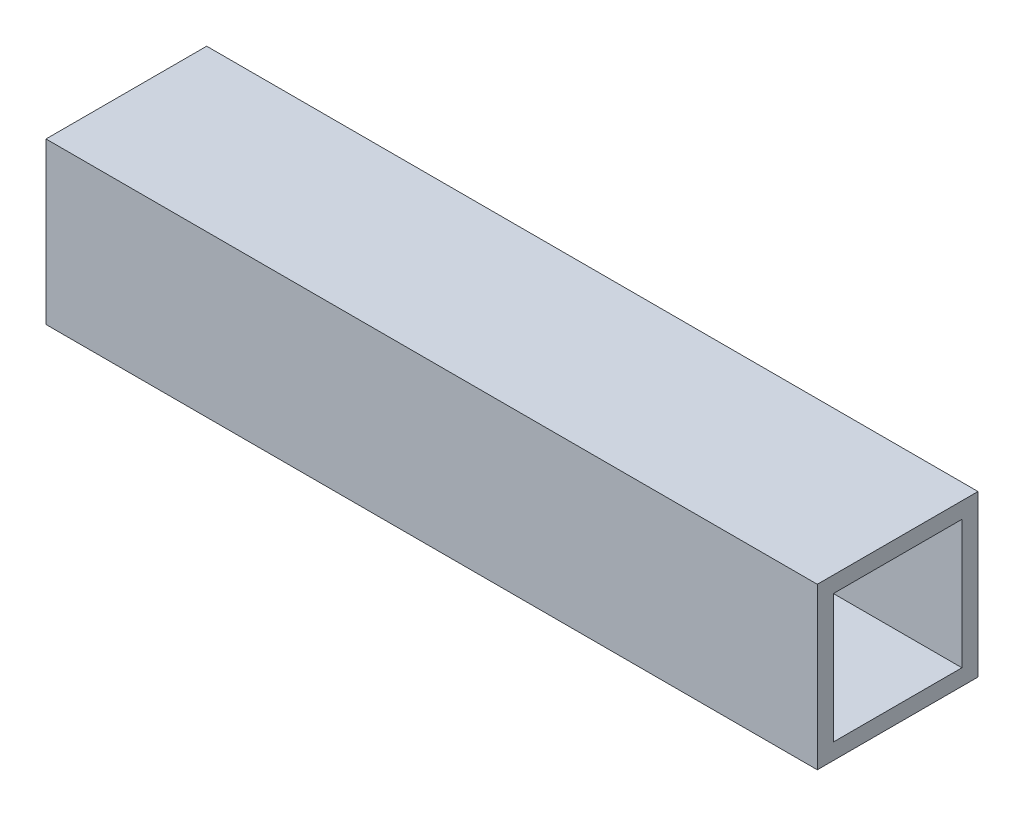
ISO-10303-21;
HEADER;
FILE_DESCRIPTION(('STEP AP214'),'2;1');
FILE_NAME('part.step','',(''),(''),'','','');
FILE_SCHEMA(('AUTOMOTIVE_DESIGN { 1 0 10303 214 1 1 1 1 }'));
ENDSEC;
DATA;
#1=APPLICATION_CONTEXT('core data for automotive mechanical design processes');
#2=APPLICATION_PROTOCOL_DEFINITION('international standard','automotive_design',2000,#1);
#3=PRODUCT_CONTEXT('',#1,'mechanical');
#4=PRODUCT('Part','Part','',(#3));
#5=PRODUCT_RELATED_PRODUCT_CATEGORY('part','',(#4));
#6=PRODUCT_DEFINITION_FORMATION('','',#4);
#7=PRODUCT_DEFINITION_CONTEXT('part definition',#1,'design');
#8=PRODUCT_DEFINITION('design','',#6,#7);
#9=PRODUCT_DEFINITION_SHAPE('','',#8);
#10=(LENGTH_UNIT() NAMED_UNIT(*) SI_UNIT(.MILLI.,.METRE.));
#11=(NAMED_UNIT(*) PLANE_ANGLE_UNIT() SI_UNIT($,.RADIAN.));
#12=(NAMED_UNIT(*) SI_UNIT($,.STERADIAN.) SOLID_ANGLE_UNIT());
#13=UNCERTAINTY_MEASURE_WITH_UNIT(LENGTH_MEASURE(1.E-05),#10,'distance_accuracy_value','');
#14=(GEOMETRIC_REPRESENTATION_CONTEXT(3) GLOBAL_UNCERTAINTY_ASSIGNED_CONTEXT((#13)) GLOBAL_UNIT_ASSIGNED_CONTEXT((#10,
#11,#12)) REPRESENTATION_CONTEXT('',''));
#15=CARTESIAN_POINT('',(0.,0.,0.));
#16=DIRECTION('',(0.,0.,1.));
#17=DIRECTION('',(1.,0.,0.));
#18=AXIS2_PLACEMENT_3D('',#15,#16,#17);
#19=CARTESIAN_POINT('',(152.4,0.,0.));
#20=DIRECTION('',(1.,0.,0.));
#21=DIRECTION('',(0.,0.,-1.));
#22=AXIS2_PLACEMENT_3D('',#19,#20,#21);
#23=PLANE('',#22);
#24=DIRECTION('',(0.,0.,-1.));
#25=VECTOR('',#24,1.);
#26=CARTESIAN_POINT('',(152.4,-31.75,31.75));
#27=LINE('',#26,#25);
#28=CARTESIAN_POINT('',(152.4,-31.75,31.75));
#29=VERTEX_POINT('',#28);
#30=CARTESIAN_POINT('',(152.4,-31.75,-31.75));
#31=VERTEX_POINT('',#30);
#32=EDGE_CURVE('E141',#29,#31,#27,.T.);
#33=ORIENTED_EDGE('',*,*,#32,.T.);
#34=DIRECTION('',(0.,1.,0.));
#35=VECTOR('',#34,1.);
#36=CARTESIAN_POINT('',(152.4,-31.75,-31.75));
#37=LINE('',#36,#35);
#38=CARTESIAN_POINT('',(152.4,31.75,-31.75));
#39=VERTEX_POINT('',#38);
#40=EDGE_CURVE('E144',#31,#39,#37,.T.);
#41=ORIENTED_EDGE('',*,*,#40,.T.);
#42=DIRECTION('',(0.,0.,1.));
#43=VECTOR('',#42,1.);
#44=CARTESIAN_POINT('',(152.4,31.75,31.75));
#45=LINE('',#44,#43);
#46=CARTESIAN_POINT('',(152.4,31.75,31.75));
#47=VERTEX_POINT('',#46);
#48=EDGE_CURVE('E147',#39,#47,#45,.T.);
#49=ORIENTED_EDGE('',*,*,#48,.T.);
#50=DIRECTION('',(0.,-1.,0.));
#51=VECTOR('',#50,1.);
#52=CARTESIAN_POINT('',(152.4,-31.75,31.75));
#53=LINE('',#52,#51);
#54=EDGE_CURVE('E149',#47,#29,#53,.T.);
#55=ORIENTED_EDGE('',*,*,#54,.T.);
#56=EDGE_LOOP('',(#33,#41,#49,#55));
#57=FACE_BOUND('',#56,.T.);
#58=DIRECTION('',(0.,0.,1.));
#59=VECTOR('',#58,1.);
#60=CARTESIAN_POINT('',(152.4,25.4,25.4));
#61=LINE('',#60,#59);
#62=CARTESIAN_POINT('',(152.4,25.4,-25.4));
#63=VERTEX_POINT('',#62);
#64=CARTESIAN_POINT('',(152.4,25.4,25.4));
#65=VERTEX_POINT('',#64);
#66=EDGE_CURVE('E113',#63,#65,#61,.T.);
#67=ORIENTED_EDGE('',*,*,#66,.F.);
#68=DIRECTION('',(0.,1.,0.));
#69=VECTOR('',#68,1.);
#70=CARTESIAN_POINT('',(152.4,-25.4,-25.4));
#71=LINE('',#70,#69);
#72=CARTESIAN_POINT('',(152.4,-25.4,-25.4));
#73=VERTEX_POINT('',#72);
#74=EDGE_CURVE('E105',#73,#63,#71,.T.);
#75=ORIENTED_EDGE('',*,*,#74,.F.);
#76=DIRECTION('',(0.,0.,-1.));
#77=VECTOR('',#76,1.);
#78=CARTESIAN_POINT('',(152.4,-25.4,25.4));
#79=LINE('',#78,#77);
#80=CARTESIAN_POINT('',(152.4,-25.4,25.4));
#81=VERTEX_POINT('',#80);
#82=EDGE_CURVE('E127',#81,#73,#79,.T.);
#83=ORIENTED_EDGE('',*,*,#82,.F.);
#84=DIRECTION('',(0.,-1.,0.));
#85=VECTOR('',#84,1.);
#86=CARTESIAN_POINT('',(152.4,-25.4,25.4));
#87=LINE('',#86,#85);
#88=EDGE_CURVE('E125',#65,#81,#87,.T.);
#89=ORIENTED_EDGE('',*,*,#88,.F.);
#90=EDGE_LOOP('',(#67,#75,#83,#89));
#91=FACE_BOUND('',#90,.T.);
#92=ADVANCED_FACE('F40',(#57,#91),#23,.T.);
#93=CARTESIAN_POINT('',(-152.4,0.,0.));
#94=DIRECTION('',(1.,0.,0.));
#95=DIRECTION('',(0.,0.,-1.));
#96=AXIS2_PLACEMENT_3D('',#93,#94,#95);
#97=PLANE('',#96);
#98=DIRECTION('',(0.,0.,-1.));
#99=VECTOR('',#98,1.);
#100=CARTESIAN_POINT('',(-152.4,-31.75,31.75));
#101=LINE('',#100,#99);
#102=CARTESIAN_POINT('',(-152.4,-31.75,31.75));
#103=VERTEX_POINT('',#102);
#104=CARTESIAN_POINT('',(-152.4,-31.75,-31.75));
#105=VERTEX_POINT('',#104);
#106=EDGE_CURVE('E121',#103,#105,#101,.T.);
#107=ORIENTED_EDGE('',*,*,#106,.F.);
#108=DIRECTION('',(0.,-1.,0.));
#109=VECTOR('',#108,1.);
#110=CARTESIAN_POINT('',(-152.4,-31.75,31.75));
#111=LINE('',#110,#109);
#112=CARTESIAN_POINT('',(-152.4,31.75,31.75));
#113=VERTEX_POINT('',#112);
#114=EDGE_CURVE('E145',#113,#103,#111,.T.);
#115=ORIENTED_EDGE('',*,*,#114,.F.);
#116=DIRECTION('',(0.,0.,1.));
#117=VECTOR('',#116,1.);
#118=CARTESIAN_POINT('',(-152.4,31.75,31.75));
#119=LINE('',#118,#117);
#120=CARTESIAN_POINT('',(-152.4,31.75,-31.75));
#121=VERTEX_POINT('',#120);
#122=EDGE_CURVE('E156',#121,#113,#119,.T.);
#123=ORIENTED_EDGE('',*,*,#122,.F.);
#124=DIRECTION('',(0.,1.,0.));
#125=VECTOR('',#124,1.);
#126=CARTESIAN_POINT('',(-152.4,-31.75,-31.75));
#127=LINE('',#126,#125);
#128=EDGE_CURVE('E154',#105,#121,#127,.T.);
#129=ORIENTED_EDGE('',*,*,#128,.F.);
#130=EDGE_LOOP('',(#107,#115,#123,#129));
#131=FACE_BOUND('',#130,.T.);
#132=DIRECTION('',(0.,1.,0.));
#133=VECTOR('',#132,1.);
#134=CARTESIAN_POINT('',(-152.4,-25.4,-25.4));
#135=LINE('',#134,#133);
#136=CARTESIAN_POINT('',(-152.4,-25.4,-25.4));
#137=VERTEX_POINT('',#136);
#138=CARTESIAN_POINT('',(-152.4,25.4,-25.4));
#139=VERTEX_POINT('',#138);
#140=EDGE_CURVE('E63',#137,#139,#135,.T.);
#141=ORIENTED_EDGE('',*,*,#140,.T.);
#142=DIRECTION('',(0.,0.,1.));
#143=VECTOR('',#142,1.);
#144=CARTESIAN_POINT('',(-152.4,25.4,25.4));
#145=LINE('',#144,#143);
#146=CARTESIAN_POINT('',(-152.4,25.4,25.4));
#147=VERTEX_POINT('',#146);
#148=EDGE_CURVE('E120',#139,#147,#145,.T.);
#149=ORIENTED_EDGE('',*,*,#148,.T.);
#150=DIRECTION('',(0.,-1.,0.));
#151=VECTOR('',#150,1.);
#152=CARTESIAN_POINT('',(-152.4,-25.4,25.4));
#153=LINE('',#152,#151);
#154=CARTESIAN_POINT('',(-152.4,-25.4,25.4));
#155=VERTEX_POINT('',#154);
#156=EDGE_CURVE('E133',#147,#155,#153,.T.);
#157=ORIENTED_EDGE('',*,*,#156,.T.);
#158=DIRECTION('',(0.,0.,-1.));
#159=VECTOR('',#158,1.);
#160=CARTESIAN_POINT('',(-152.4,-25.4,25.4));
#161=LINE('',#160,#159);
#162=EDGE_CURVE('E114',#155,#137,#161,.T.);
#163=ORIENTED_EDGE('',*,*,#162,.T.);
#164=EDGE_LOOP('',(#141,#149,#157,#163));
#165=FACE_BOUND('',#164,.T.);
#166=ADVANCED_FACE('F174',(#131,#165),#97,.F.);
#167=CARTESIAN_POINT('',(152.4,-31.75,31.75));
#168=DIRECTION('',(0.,1.,0.));
#169=DIRECTION('',(0.,0.,1.));
#170=AXIS2_PLACEMENT_3D('',#167,#168,#169);
#171=PLANE('',#170);
#172=ORIENTED_EDGE('',*,*,#106,.T.);
#173=DIRECTION('',(-1.,0.,0.));
#174=VECTOR('',#173,1.);
#175=CARTESIAN_POINT('',(152.4,-31.75,-31.75));
#176=LINE('',#175,#174);
#177=EDGE_CURVE('E11',#31,#105,#176,.T.);
#178=ORIENTED_EDGE('',*,*,#177,.F.);
#179=ORIENTED_EDGE('',*,*,#32,.F.);
#180=DIRECTION('',(-1.,0.,0.));
#181=VECTOR('',#180,1.);
#182=CARTESIAN_POINT('',(152.4,-31.75,31.75));
#183=LINE('',#182,#181);
#184=EDGE_CURVE('E151',#29,#103,#183,.T.);
#185=ORIENTED_EDGE('',*,*,#184,.T.);
#186=EDGE_LOOP('',(#172,#178,#179,#185));
#187=FACE_BOUND('',#186,.T.);
#188=ADVANCED_FACE('F42',(#187),#171,.F.);
#189=CARTESIAN_POINT('',(152.4,-31.75,-31.75));
#190=DIRECTION('',(0.,0.,1.));
#191=DIRECTION('',(1.,0.,0.));
#192=AXIS2_PLACEMENT_3D('',#189,#190,#191);
#193=PLANE('',#192);
#194=ORIENTED_EDGE('',*,*,#128,.T.);
#195=DIRECTION('',(-1.,0.,0.));
#196=VECTOR('',#195,1.);
#197=CARTESIAN_POINT('',(152.4,31.75,-31.75));
#198=LINE('',#197,#196);
#199=EDGE_CURVE('E48',#39,#121,#198,.T.);
#200=ORIENTED_EDGE('',*,*,#199,.F.);
#201=ORIENTED_EDGE('',*,*,#40,.F.);
#202=ORIENTED_EDGE('',*,*,#177,.T.);
#203=EDGE_LOOP('',(#194,#200,#201,#202));
#204=FACE_BOUND('',#203,.T.);
#205=ADVANCED_FACE('F184',(#204),#193,.F.);
#206=CARTESIAN_POINT('',(152.4,31.75,31.75));
#207=DIRECTION('',(0.,-1.,0.));
#208=DIRECTION('',(0.,0.,-1.));
#209=AXIS2_PLACEMENT_3D('',#206,#207,#208);
#210=PLANE('',#209);
#211=ORIENTED_EDGE('',*,*,#122,.T.);
#212=DIRECTION('',(-1.,0.,0.));
#213=VECTOR('',#212,1.);
#214=CARTESIAN_POINT('',(152.4,31.75,31.75));
#215=LINE('',#214,#213);
#216=EDGE_CURVE('E161',#47,#113,#215,.T.);
#217=ORIENTED_EDGE('',*,*,#216,.F.);
#218=ORIENTED_EDGE('',*,*,#48,.F.);
#219=ORIENTED_EDGE('',*,*,#199,.T.);
#220=EDGE_LOOP('',(#211,#217,#218,#219));
#221=FACE_BOUND('',#220,.T.);
#222=ADVANCED_FACE('F168',(#221),#210,.F.);
#223=CARTESIAN_POINT('',(152.4,-31.75,31.75));
#224=DIRECTION('',(0.,0.,-1.));
#225=DIRECTION('',(-1.,0.,0.));
#226=AXIS2_PLACEMENT_3D('',#223,#224,#225);
#227=PLANE('',#226);
#228=ORIENTED_EDGE('',*,*,#114,.T.);
#229=ORIENTED_EDGE('',*,*,#184,.F.);
#230=ORIENTED_EDGE('',*,*,#54,.F.);
#231=ORIENTED_EDGE('',*,*,#216,.T.);
#232=EDGE_LOOP('',(#228,#229,#230,#231));
#233=FACE_BOUND('',#232,.T.);
#234=ADVANCED_FACE('F178',(#233),#227,.F.);
#235=CARTESIAN_POINT('',(152.4,-25.4,-25.4));
#236=DIRECTION('',(0.,0.,1.));
#237=DIRECTION('',(1.,0.,0.));
#238=AXIS2_PLACEMENT_3D('',#235,#236,#237);
#239=PLANE('',#238);
#240=ORIENTED_EDGE('',*,*,#140,.F.);
#241=DIRECTION('',(-1.,0.,0.));
#242=VECTOR('',#241,1.);
#243=CARTESIAN_POINT('',(152.4,-25.4,-25.4));
#244=LINE('',#243,#242);
#245=EDGE_CURVE('E109',#73,#137,#244,.T.);
#246=ORIENTED_EDGE('',*,*,#245,.F.);
#247=ORIENTED_EDGE('',*,*,#74,.T.);
#248=DIRECTION('',(-1.,0.,0.));
#249=VECTOR('',#248,1.);
#250=CARTESIAN_POINT('',(152.4,25.4,-25.4));
#251=LINE('',#250,#249);
#252=EDGE_CURVE('E108',#63,#139,#251,.T.);
#253=ORIENTED_EDGE('',*,*,#252,.T.);
#254=EDGE_LOOP('',(#240,#246,#247,#253));
#255=FACE_BOUND('',#254,.T.);
#256=ADVANCED_FACE('F107',(#255),#239,.T.);
#257=CARTESIAN_POINT('',(152.4,25.4,25.4));
#258=DIRECTION('',(0.,-1.,0.));
#259=DIRECTION('',(0.,0.,-1.));
#260=AXIS2_PLACEMENT_3D('',#257,#258,#259);
#261=PLANE('',#260);
#262=ORIENTED_EDGE('',*,*,#148,.F.);
#263=ORIENTED_EDGE('',*,*,#252,.F.);
#264=ORIENTED_EDGE('',*,*,#66,.T.);
#265=DIRECTION('',(-1.,0.,0.));
#266=VECTOR('',#265,1.);
#267=CARTESIAN_POINT('',(152.4,25.4,25.4));
#268=LINE('',#267,#266);
#269=EDGE_CURVE('E122',#65,#147,#268,.T.);
#270=ORIENTED_EDGE('',*,*,#269,.T.);
#271=EDGE_LOOP('',(#262,#263,#264,#270));
#272=FACE_BOUND('',#271,.T.);
#273=ADVANCED_FACE('F117',(#272),#261,.T.);
#274=CARTESIAN_POINT('',(152.4,-25.4,25.4));
#275=DIRECTION('',(0.,0.,-1.));
#276=DIRECTION('',(-1.,0.,0.));
#277=AXIS2_PLACEMENT_3D('',#274,#275,#276);
#278=PLANE('',#277);
#279=ORIENTED_EDGE('',*,*,#156,.F.);
#280=ORIENTED_EDGE('',*,*,#269,.F.);
#281=ORIENTED_EDGE('',*,*,#88,.T.);
#282=DIRECTION('',(-1.,0.,0.));
#283=VECTOR('',#282,1.);
#284=CARTESIAN_POINT('',(152.4,-25.4,25.4));
#285=LINE('',#284,#283);
#286=EDGE_CURVE('E55',#81,#155,#285,.T.);
#287=ORIENTED_EDGE('',*,*,#286,.T.);
#288=EDGE_LOOP('',(#279,#280,#281,#287));
#289=FACE_BOUND('',#288,.T.);
#290=ADVANCED_FACE('F207',(#289),#278,.T.);
#291=CARTESIAN_POINT('',(152.4,-25.4,25.4));
#292=DIRECTION('',(0.,1.,0.));
#293=DIRECTION('',(0.,0.,1.));
#294=AXIS2_PLACEMENT_3D('',#291,#292,#293);
#295=PLANE('',#294);
#296=ORIENTED_EDGE('',*,*,#162,.F.);
#297=ORIENTED_EDGE('',*,*,#286,.F.);
#298=ORIENTED_EDGE('',*,*,#82,.T.);
#299=ORIENTED_EDGE('',*,*,#245,.T.);
#300=EDGE_LOOP('',(#296,#297,#298,#299));
#301=FACE_BOUND('',#300,.T.);
#302=ADVANCED_FACE('F211',(#301),#295,.T.);
#303=CLOSED_SHELL('',(#92,#166,#188,#205,#222,#234,#256,#273,#290,#302));
#304=MANIFOLD_SOLID_BREP('B2',#303);
#305=ADVANCED_BREP_SHAPE_REPRESENTATION('',(#18,#304),#14);
#306=SHAPE_DEFINITION_REPRESENTATION(#9,#305);
ENDSEC;
END-ISO-10303-21;
